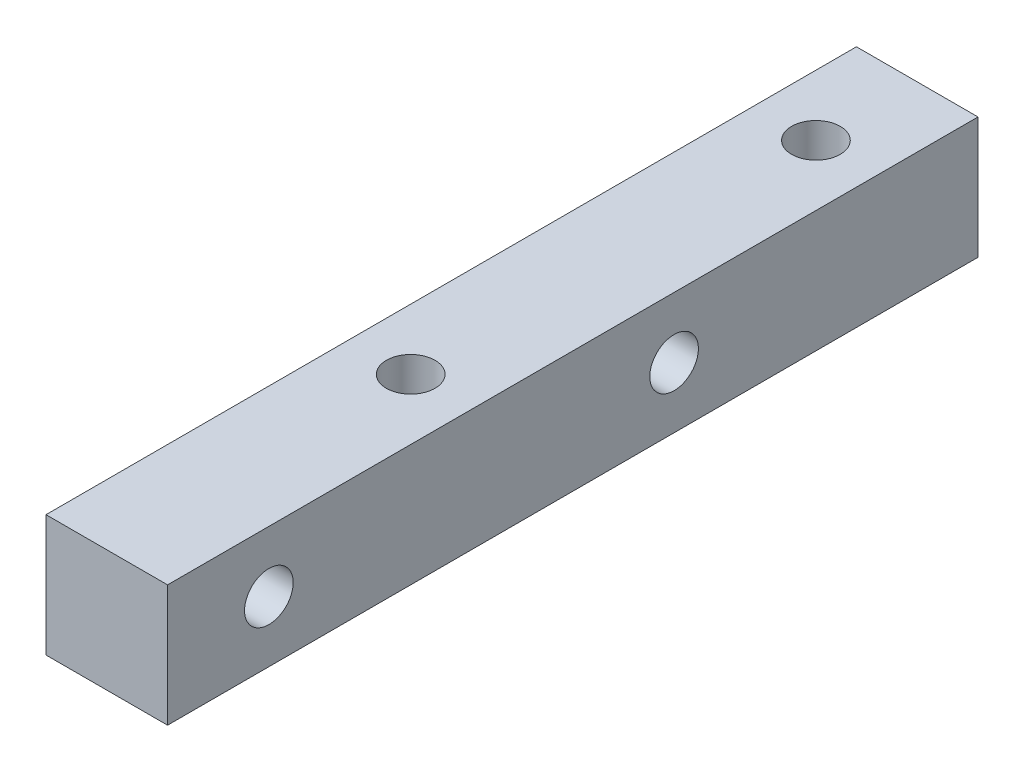
ISO-10303-21;
HEADER;
FILE_DESCRIPTION(('STEP AP214'),'2;1');
FILE_NAME('part.step','',(''),(''),'','','');
FILE_SCHEMA(('AUTOMOTIVE_DESIGN { 1 0 10303 214 1 1 1 1 }'));
ENDSEC;
DATA;
#1=APPLICATION_CONTEXT('core data for automotive mechanical design processes');
#2=APPLICATION_PROTOCOL_DEFINITION('international standard','automotive_design',2000,#1);
#3=PRODUCT_CONTEXT('',#1,'mechanical');
#4=PRODUCT('Part','Part','',(#3));
#5=PRODUCT_RELATED_PRODUCT_CATEGORY('part','',(#4));
#6=PRODUCT_DEFINITION_FORMATION('','',#4);
#7=PRODUCT_DEFINITION_CONTEXT('part definition',#1,'design');
#8=PRODUCT_DEFINITION('design','',#6,#7);
#9=PRODUCT_DEFINITION_SHAPE('','',#8);
#10=(LENGTH_UNIT() NAMED_UNIT(*) SI_UNIT(.MILLI.,.METRE.));
#11=(NAMED_UNIT(*) PLANE_ANGLE_UNIT() SI_UNIT($,.RADIAN.));
#12=(NAMED_UNIT(*) SI_UNIT($,.STERADIAN.) SOLID_ANGLE_UNIT());
#13=UNCERTAINTY_MEASURE_WITH_UNIT(LENGTH_MEASURE(1.E-05),#10,'distance_accuracy_value','');
#14=(GEOMETRIC_REPRESENTATION_CONTEXT(3) GLOBAL_UNCERTAINTY_ASSIGNED_CONTEXT((#13)) GLOBAL_UNIT_ASSIGNED_CONTEXT((#10,
#11,#12)) REPRESENTATION_CONTEXT('',''));
#15=CARTESIAN_POINT('',(0.,0.,0.));
#16=DIRECTION('',(0.,0.,1.));
#17=DIRECTION('',(1.,0.,0.));
#18=AXIS2_PLACEMENT_3D('',#15,#16,#17);
#19=CARTESIAN_POINT('',(0.,0.,40.));
#20=DIRECTION('',(1.,0.,0.));
#21=DIRECTION('',(0.,0.,-1.));
#22=AXIS2_PLACEMENT_3D('',#19,#20,#21);
#23=PLANE('',#22);
#24=CARTESIAN_POINT('',(0.,3.,35.));
#25=DIRECTION('',(-1.,0.,0.));
#26=DIRECTION('',(0.,0.,1.));
#27=AXIS2_PLACEMENT_3D('',#24,#25,#26);
#28=CIRCLE('',#27,1.2);
#29=CARTESIAN_POINT('',(0.,3.,36.2));
#30=VERTEX_POINT('',#29);
#31=EDGE_CURVE('E114',#30,#30,#28,.T.);
#32=ORIENTED_EDGE('',*,*,#31,.F.);
#33=EDGE_LOOP('',(#32));
#34=FACE_BOUND('',#33,.T.);
#35=CARTESIAN_POINT('',(0.,3.,15.));
#36=DIRECTION('',(-1.,0.,0.));
#37=DIRECTION('',(0.,0.,1.));
#38=AXIS2_PLACEMENT_3D('',#35,#36,#37);
#39=CIRCLE('',#38,1.2);
#40=CARTESIAN_POINT('',(0.,3.,16.2));
#41=VERTEX_POINT('',#40);
#42=EDGE_CURVE('E120',#41,#41,#39,.T.);
#43=ORIENTED_EDGE('',*,*,#42,.F.);
#44=EDGE_LOOP('',(#43));
#45=FACE_BOUND('',#44,.T.);
#46=DIRECTION('',(0.,-1.,0.));
#47=VECTOR('',#46,1.);
#48=CARTESIAN_POINT('',(0.,0.,0.));
#49=LINE('',#48,#47);
#50=CARTESIAN_POINT('',(0.,6.,0.));
#51=VERTEX_POINT('',#50);
#52=CARTESIAN_POINT('',(0.,0.,0.));
#53=VERTEX_POINT('',#52);
#54=EDGE_CURVE('E104',#51,#53,#49,.T.);
#55=ORIENTED_EDGE('',*,*,#54,.T.);
#56=DIRECTION('',(0.,0.,-1.));
#57=VECTOR('',#56,1.);
#58=CARTESIAN_POINT('',(0.,0.,40.));
#59=LINE('',#58,#57);
#60=CARTESIAN_POINT('',(0.,0.,40.));
#61=VERTEX_POINT('',#60);
#62=EDGE_CURVE('E11',#61,#53,#59,.T.);
#63=ORIENTED_EDGE('',*,*,#62,.F.);
#64=DIRECTION('',(0.,-1.,0.));
#65=VECTOR('',#64,1.);
#66=CARTESIAN_POINT('',(0.,0.,40.));
#67=LINE('',#66,#65);
#68=CARTESIAN_POINT('',(0.,6.,40.));
#69=VERTEX_POINT('',#68);
#70=EDGE_CURVE('E91',#69,#61,#67,.T.);
#71=ORIENTED_EDGE('',*,*,#70,.F.);
#72=DIRECTION('',(0.,0.,-1.));
#73=VECTOR('',#72,1.);
#74=CARTESIAN_POINT('',(0.,6.,40.));
#75=LINE('',#74,#73);
#76=EDGE_CURVE('E100',#69,#51,#75,.T.);
#77=ORIENTED_EDGE('',*,*,#76,.T.);
#78=EDGE_LOOP('',(#55,#63,#71,#77));
#79=FACE_BOUND('',#78,.T.);
#80=ADVANCED_FACE('F38',(#34,#45,#79),#23,.F.);
#81=CARTESIAN_POINT('',(0.,0.,40.));
#82=DIRECTION('',(0.,1.,0.));
#83=DIRECTION('',(0.,0.,1.));
#84=AXIS2_PLACEMENT_3D('',#81,#82,#83);
#85=PLANE('',#84);
#86=CARTESIAN_POINT('',(3.,0.,5.));
#87=DIRECTION('',(0.,1.,0.));
#88=DIRECTION('',(0.,0.,1.));
#89=AXIS2_PLACEMENT_3D('',#86,#87,#88);
#90=CIRCLE('',#89,1.2);
#91=CARTESIAN_POINT('',(3.,0.,6.2));
#92=VERTEX_POINT('',#91);
#93=EDGE_CURVE('E107',#92,#92,#90,.T.);
#94=ORIENTED_EDGE('',*,*,#93,.T.);
#95=EDGE_LOOP('',(#94));
#96=FACE_BOUND('',#95,.T.);
#97=CARTESIAN_POINT('',(3.,0.,25.));
#98=DIRECTION('',(0.,1.,0.));
#99=DIRECTION('',(0.,0.,1.));
#100=AXIS2_PLACEMENT_3D('',#97,#98,#99);
#101=CIRCLE('',#100,1.2);
#102=CARTESIAN_POINT('',(3.,0.,26.2));
#103=VERTEX_POINT('',#102);
#104=EDGE_CURVE('E130',#103,#103,#101,.T.);
#105=ORIENTED_EDGE('',*,*,#104,.T.);
#106=EDGE_LOOP('',(#105));
#107=FACE_BOUND('',#106,.T.);
#108=DIRECTION('',(1.,0.,0.));
#109=VECTOR('',#108,1.);
#110=CARTESIAN_POINT('',(0.,0.,0.));
#111=LINE('',#110,#109);
#112=CARTESIAN_POINT('',(6.,0.,0.));
#113=VERTEX_POINT('',#112);
#114=EDGE_CURVE('E95',#53,#113,#111,.T.);
#115=ORIENTED_EDGE('',*,*,#114,.T.);
#116=DIRECTION('',(0.,0.,-1.));
#117=VECTOR('',#116,1.);
#118=CARTESIAN_POINT('',(6.,0.,40.));
#119=LINE('',#118,#117);
#120=CARTESIAN_POINT('',(6.,0.,40.));
#121=VERTEX_POINT('',#120);
#122=EDGE_CURVE('E47',#121,#113,#119,.T.);
#123=ORIENTED_EDGE('',*,*,#122,.F.);
#124=DIRECTION('',(1.,0.,0.));
#125=VECTOR('',#124,1.);
#126=CARTESIAN_POINT('',(0.,0.,40.));
#127=LINE('',#126,#125);
#128=EDGE_CURVE('E86',#61,#121,#127,.T.);
#129=ORIENTED_EDGE('',*,*,#128,.F.);
#130=ORIENTED_EDGE('',*,*,#62,.T.);
#131=EDGE_LOOP('',(#115,#123,#129,#130));
#132=FACE_BOUND('',#131,.T.);
#133=ADVANCED_FACE('F94',(#96,#107,#132),#85,.F.);
#134=CARTESIAN_POINT('',(6.,0.,40.));
#135=DIRECTION('',(-1.,0.,0.));
#136=DIRECTION('',(0.,0.,1.));
#137=AXIS2_PLACEMENT_3D('',#134,#135,#136);
#138=PLANE('',#137);
#139=CARTESIAN_POINT('',(6.,3.,35.));
#140=DIRECTION('',(-1.,0.,0.));
#141=DIRECTION('',(0.,0.,1.));
#142=AXIS2_PLACEMENT_3D('',#139,#140,#141);
#143=CIRCLE('',#142,1.2);
#144=CARTESIAN_POINT('',(6.,3.,36.2));
#145=VERTEX_POINT('',#144);
#146=EDGE_CURVE('E41',#145,#145,#143,.T.);
#147=ORIENTED_EDGE('',*,*,#146,.T.);
#148=EDGE_LOOP('',(#147));
#149=FACE_BOUND('',#148,.T.);
#150=CARTESIAN_POINT('',(6.,3.,15.));
#151=DIRECTION('',(-1.,0.,0.));
#152=DIRECTION('',(0.,0.,1.));
#153=AXIS2_PLACEMENT_3D('',#150,#151,#152);
#154=CIRCLE('',#153,1.2);
#155=CARTESIAN_POINT('',(6.,3.,16.2));
#156=VERTEX_POINT('',#155);
#157=EDGE_CURVE('E112',#156,#156,#154,.T.);
#158=ORIENTED_EDGE('',*,*,#157,.T.);
#159=EDGE_LOOP('',(#158));
#160=FACE_BOUND('',#159,.T.);
#161=DIRECTION('',(0.,1.,0.));
#162=VECTOR('',#161,1.);
#163=CARTESIAN_POINT('',(6.,0.,0.));
#164=LINE('',#163,#162);
#165=CARTESIAN_POINT('',(6.,6.,0.));
#166=VERTEX_POINT('',#165);
#167=EDGE_CURVE('E73',#113,#166,#164,.T.);
#168=ORIENTED_EDGE('',*,*,#167,.T.);
#169=DIRECTION('',(0.,0.,-1.));
#170=VECTOR('',#169,1.);
#171=CARTESIAN_POINT('',(6.,6.,40.));
#172=LINE('',#171,#170);
#173=CARTESIAN_POINT('',(6.,6.,40.));
#174=VERTEX_POINT('',#173);
#175=EDGE_CURVE('E96',#174,#166,#172,.T.);
#176=ORIENTED_EDGE('',*,*,#175,.F.);
#177=DIRECTION('',(0.,1.,0.));
#178=VECTOR('',#177,1.);
#179=CARTESIAN_POINT('',(6.,0.,40.));
#180=LINE('',#179,#178);
#181=EDGE_CURVE('E89',#121,#174,#180,.T.);
#182=ORIENTED_EDGE('',*,*,#181,.F.);
#183=ORIENTED_EDGE('',*,*,#122,.T.);
#184=EDGE_LOOP('',(#168,#176,#182,#183));
#185=FACE_BOUND('',#184,.T.);
#186=ADVANCED_FACE('F98',(#149,#160,#185),#138,.F.);
#187=CARTESIAN_POINT('',(0.,6.,40.));
#188=DIRECTION('',(0.,-1.,0.));
#189=DIRECTION('',(0.,0.,-1.));
#190=AXIS2_PLACEMENT_3D('',#187,#188,#189);
#191=PLANE('',#190);
#192=CARTESIAN_POINT('',(3.,6.,5.));
#193=DIRECTION('',(0.,1.,0.));
#194=DIRECTION('',(0.,0.,1.));
#195=AXIS2_PLACEMENT_3D('',#192,#193,#194);
#196=CIRCLE('',#195,1.2);
#197=CARTESIAN_POINT('',(3.,6.,6.2));
#198=VERTEX_POINT('',#197);
#199=EDGE_CURVE('E127',#198,#198,#196,.T.);
#200=ORIENTED_EDGE('',*,*,#199,.F.);
#201=EDGE_LOOP('',(#200));
#202=FACE_BOUND('',#201,.T.);
#203=CARTESIAN_POINT('',(3.,6.,25.));
#204=DIRECTION('',(0.,1.,0.));
#205=DIRECTION('',(0.,0.,1.));
#206=AXIS2_PLACEMENT_3D('',#203,#204,#205);
#207=CIRCLE('',#206,1.2);
#208=CARTESIAN_POINT('',(3.,6.,26.2));
#209=VERTEX_POINT('',#208);
#210=EDGE_CURVE('E118',#209,#209,#207,.T.);
#211=ORIENTED_EDGE('',*,*,#210,.F.);
#212=EDGE_LOOP('',(#211));
#213=FACE_BOUND('',#212,.T.);
#214=DIRECTION('',(-1.,0.,0.));
#215=VECTOR('',#214,1.);
#216=CARTESIAN_POINT('',(0.,6.,0.));
#217=LINE('',#216,#215);
#218=EDGE_CURVE('E79',#166,#51,#217,.T.);
#219=ORIENTED_EDGE('',*,*,#218,.T.);
#220=ORIENTED_EDGE('',*,*,#76,.F.);
#221=DIRECTION('',(-1.,0.,0.));
#222=VECTOR('',#221,1.);
#223=CARTESIAN_POINT('',(0.,6.,40.));
#224=LINE('',#223,#222);
#225=EDGE_CURVE('E56',#174,#69,#224,.T.);
#226=ORIENTED_EDGE('',*,*,#225,.F.);
#227=ORIENTED_EDGE('',*,*,#175,.T.);
#228=EDGE_LOOP('',(#219,#220,#226,#227));
#229=FACE_BOUND('',#228,.T.);
#230=ADVANCED_FACE('F171',(#202,#213,#229),#191,.F.);
#231=CARTESIAN_POINT('',(0.,0.,40.));
#232=DIRECTION('',(0.,0.,-1.));
#233=DIRECTION('',(-1.,0.,0.));
#234=AXIS2_PLACEMENT_3D('',#231,#232,#233);
#235=PLANE('',#234);
#236=ORIENTED_EDGE('',*,*,#70,.T.);
#237=ORIENTED_EDGE('',*,*,#128,.T.);
#238=ORIENTED_EDGE('',*,*,#181,.T.);
#239=ORIENTED_EDGE('',*,*,#225,.T.);
#240=EDGE_LOOP('',(#236,#237,#238,#239));
#241=FACE_BOUND('',#240,.T.);
#242=ADVANCED_FACE('F87',(#241),#235,.F.);
#243=CARTESIAN_POINT('',(0.,0.,0.));
#244=DIRECTION('',(0.,0.,-1.));
#245=DIRECTION('',(-1.,0.,0.));
#246=AXIS2_PLACEMENT_3D('',#243,#244,#245);
#247=PLANE('',#246);
#248=ORIENTED_EDGE('',*,*,#54,.F.);
#249=ORIENTED_EDGE('',*,*,#218,.F.);
#250=ORIENTED_EDGE('',*,*,#167,.F.);
#251=ORIENTED_EDGE('',*,*,#114,.F.);
#252=EDGE_LOOP('',(#248,#249,#250,#251));
#253=FACE_BOUND('',#252,.T.);
#254=ADVANCED_FACE('F153',(#253),#247,.T.);
#255=CARTESIAN_POINT('',(3.,-44.,25.));
#256=DIRECTION('',(0.,1.,0.));
#257=DIRECTION('',(0.,0.,1.));
#258=AXIS2_PLACEMENT_3D('',#255,#256,#257);
#259=CYLINDRICAL_SURFACE('',#258,1.2);
#260=ORIENTED_EDGE('',*,*,#210,.T.);
#261=EDGE_LOOP('',(#260));
#262=FACE_BOUND('',#261,.T.);
#263=ORIENTED_EDGE('',*,*,#104,.F.);
#264=EDGE_LOOP('',(#263));
#265=FACE_BOUND('',#264,.T.);
#266=ADVANCED_FACE('F143',(#262,#265),#259,.F.);
#267=CARTESIAN_POINT('',(3.,-44.,5.));
#268=DIRECTION('',(0.,1.,0.));
#269=DIRECTION('',(0.,0.,1.));
#270=AXIS2_PLACEMENT_3D('',#267,#268,#269);
#271=CYLINDRICAL_SURFACE('',#270,1.2);
#272=ORIENTED_EDGE('',*,*,#199,.T.);
#273=EDGE_LOOP('',(#272));
#274=FACE_BOUND('',#273,.T.);
#275=ORIENTED_EDGE('',*,*,#93,.F.);
#276=EDGE_LOOP('',(#275));
#277=FACE_BOUND('',#276,.T.);
#278=ADVANCED_FACE('F140',(#274,#277),#271,.F.);
#279=CARTESIAN_POINT('',(50.,3.,15.));
#280=DIRECTION('',(-1.,0.,0.));
#281=DIRECTION('',(0.,0.,1.));
#282=AXIS2_PLACEMENT_3D('',#279,#280,#281);
#283=CYLINDRICAL_SURFACE('',#282,1.2);
#284=ORIENTED_EDGE('',*,*,#42,.T.);
#285=EDGE_LOOP('',(#284));
#286=FACE_BOUND('',#285,.T.);
#287=ORIENTED_EDGE('',*,*,#157,.F.);
#288=EDGE_LOOP('',(#287));
#289=FACE_BOUND('',#288,.T.);
#290=ADVANCED_FACE('F142',(#286,#289),#283,.F.);
#291=CARTESIAN_POINT('',(50.,3.,35.));
#292=DIRECTION('',(-1.,0.,0.));
#293=DIRECTION('',(0.,0.,1.));
#294=AXIS2_PLACEMENT_3D('',#291,#292,#293);
#295=CYLINDRICAL_SURFACE('',#294,1.2);
#296=ORIENTED_EDGE('',*,*,#31,.T.);
#297=EDGE_LOOP('',(#296));
#298=FACE_BOUND('',#297,.T.);
#299=ORIENTED_EDGE('',*,*,#146,.F.);
#300=EDGE_LOOP('',(#299));
#301=FACE_BOUND('',#300,.T.);
#302=ADVANCED_FACE('F150',(#298,#301),#295,.F.);
#303=CLOSED_SHELL('',(#80,#133,#186,#230,#242,#254,#266,#278,#290,#302));
#304=MANIFOLD_SOLID_BREP('B2',#303);
#305=ADVANCED_BREP_SHAPE_REPRESENTATION('',(#18,#304),#14);
#306=SHAPE_DEFINITION_REPRESENTATION(#9,#305);
ENDSEC;
END-ISO-10303-21;
